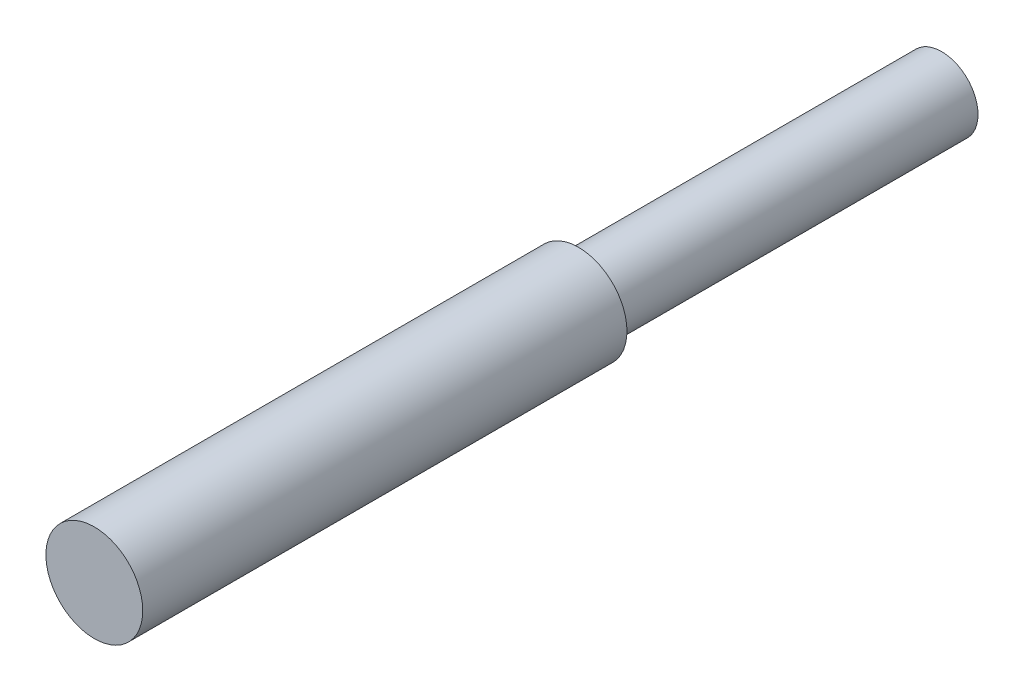
ISO-10303-21;
HEADER;
FILE_DESCRIPTION(('STEP AP214'),'2;1');
FILE_NAME('part.step','',(''),(''),'','','');
FILE_SCHEMA(('AUTOMOTIVE_DESIGN { 1 0 10303 214 1 1 1 1 }'));
ENDSEC;
DATA;
#1=APPLICATION_CONTEXT('core data for automotive mechanical design processes');
#2=APPLICATION_PROTOCOL_DEFINITION('international standard','automotive_design',2000,#1);
#3=PRODUCT_CONTEXT('',#1,'mechanical');
#4=PRODUCT('Part','Part','',(#3));
#5=PRODUCT_RELATED_PRODUCT_CATEGORY('part','',(#4));
#6=PRODUCT_DEFINITION_FORMATION('','',#4);
#7=PRODUCT_DEFINITION_CONTEXT('part definition',#1,'design');
#8=PRODUCT_DEFINITION('design','',#6,#7);
#9=PRODUCT_DEFINITION_SHAPE('','',#8);
#10=(LENGTH_UNIT() NAMED_UNIT(*) SI_UNIT(.MILLI.,.METRE.));
#11=(NAMED_UNIT(*) PLANE_ANGLE_UNIT() SI_UNIT($,.RADIAN.));
#12=(NAMED_UNIT(*) SI_UNIT($,.STERADIAN.) SOLID_ANGLE_UNIT());
#13=UNCERTAINTY_MEASURE_WITH_UNIT(LENGTH_MEASURE(1.E-05),#10,'distance_accuracy_value','');
#14=(GEOMETRIC_REPRESENTATION_CONTEXT(3) GLOBAL_UNCERTAINTY_ASSIGNED_CONTEXT((#13)) GLOBAL_UNIT_ASSIGNED_CONTEXT((#10,
#11,#12)) REPRESENTATION_CONTEXT('',''));
#15=CARTESIAN_POINT('',(0.,0.,0.));
#16=DIRECTION('',(0.,0.,1.));
#17=DIRECTION('',(1.,0.,0.));
#18=AXIS2_PLACEMENT_3D('',#15,#16,#17);
#19=CARTESIAN_POINT('',(0.,0.,150.));
#20=DIRECTION('',(0.,0.,-1.));
#21=DIRECTION('',(-1.,0.,0.));
#22=AXIS2_PLACEMENT_3D('',#19,#20,#21);
#23=CYLINDRICAL_SURFACE('',#22,15.);
#24=CARTESIAN_POINT('',(0.,0.,150.));
#25=DIRECTION('',(0.,0.,1.));
#26=DIRECTION('',(1.,0.,0.));
#27=AXIS2_PLACEMENT_3D('',#24,#25,#26);
#28=CIRCLE('',#27,15.);
#29=CARTESIAN_POINT('',(15.,0.,150.));
#30=VERTEX_POINT('',#29);
#31=EDGE_CURVE('E10',#30,#30,#28,.T.);
#32=ORIENTED_EDGE('',*,*,#31,.F.);
#33=EDGE_LOOP('',(#32));
#34=FACE_BOUND('',#33,.T.);
#35=CARTESIAN_POINT('',(0.,0.,0.));
#36=DIRECTION('',(0.,0.,1.));
#37=DIRECTION('',(1.,0.,0.));
#38=AXIS2_PLACEMENT_3D('',#35,#36,#37);
#39=CIRCLE('',#38,15.);
#40=CARTESIAN_POINT('',(15.,0.,0.));
#41=VERTEX_POINT('',#40);
#42=EDGE_CURVE('E40',#41,#41,#39,.T.);
#43=ORIENTED_EDGE('',*,*,#42,.T.);
#44=EDGE_LOOP('',(#43));
#45=FACE_BOUND('',#44,.T.);
#46=ADVANCED_FACE('F37',(#34,#45),#23,.T.);
#47=CARTESIAN_POINT('',(0.,0.,0.));
#48=DIRECTION('',(0.,0.,1.));
#49=DIRECTION('',(1.,0.,0.));
#50=AXIS2_PLACEMENT_3D('',#47,#48,#49);
#51=PLANE('',#50);
#52=ORIENTED_EDGE('',*,*,#42,.F.);
#53=EDGE_LOOP('',(#52));
#54=FACE_BOUND('',#53,.T.);
#55=ADVANCED_FACE('F64',(#54),#51,.F.);
#56=CARTESIAN_POINT('',(0.,0.,350.));
#57=DIRECTION('',(0.,0.,-1.));
#58=DIRECTION('',(-1.,0.,0.));
#59=AXIS2_PLACEMENT_3D('',#56,#57,#58);
#60=CYLINDRICAL_SURFACE('',#59,20.);
#61=CARTESIAN_POINT('',(0.,0.,350.));
#62=DIRECTION('',(0.,0.,1.));
#63=DIRECTION('',(1.,0.,0.));
#64=AXIS2_PLACEMENT_3D('',#61,#62,#63);
#65=CIRCLE('',#64,20.);
#66=CARTESIAN_POINT('',(20.,0.,350.));
#67=VERTEX_POINT('',#66);
#68=EDGE_CURVE('E49',#67,#67,#65,.T.);
#69=ORIENTED_EDGE('',*,*,#68,.F.);
#70=EDGE_LOOP('',(#69));
#71=FACE_BOUND('',#70,.T.);
#72=CARTESIAN_POINT('',(0.,0.,150.));
#73=DIRECTION('',(0.,0.,1.));
#74=DIRECTION('',(1.,0.,0.));
#75=AXIS2_PLACEMENT_3D('',#72,#73,#74);
#76=CIRCLE('',#75,20.);
#77=CARTESIAN_POINT('',(20.,0.,150.));
#78=VERTEX_POINT('',#77);
#79=EDGE_CURVE('E51',#78,#78,#76,.T.);
#80=ORIENTED_EDGE('',*,*,#79,.T.);
#81=EDGE_LOOP('',(#80));
#82=FACE_BOUND('',#81,.T.);
#83=ADVANCED_FACE('F61',(#71,#82),#60,.T.);
#84=CARTESIAN_POINT('',(0.,0.,350.));
#85=DIRECTION('',(0.,0.,1.));
#86=DIRECTION('',(1.,0.,0.));
#87=AXIS2_PLACEMENT_3D('',#84,#85,#86);
#88=PLANE('',#87);
#89=ORIENTED_EDGE('',*,*,#68,.T.);
#90=EDGE_LOOP('',(#89));
#91=FACE_BOUND('',#90,.T.);
#92=ADVANCED_FACE('F59',(#91),#88,.T.);
#93=CARTESIAN_POINT('',(0.,0.,150.));
#94=DIRECTION('',(0.,0.,1.));
#95=DIRECTION('',(1.,0.,0.));
#96=AXIS2_PLACEMENT_3D('',#93,#94,#95);
#97=PLANE('',#96);
#98=ORIENTED_EDGE('',*,*,#31,.T.);
#99=EDGE_LOOP('',(#98));
#100=FACE_BOUND('',#99,.T.);
#101=ORIENTED_EDGE('',*,*,#79,.F.);
#102=EDGE_LOOP('',(#101));
#103=FACE_BOUND('',#102,.T.);
#104=ADVANCED_FACE('F68',(#100,#103),#97,.F.);
#105=CLOSED_SHELL('',(#46,#55,#83,#92,#104));
#106=MANIFOLD_SOLID_BREP('B2',#105);
#107=ADVANCED_BREP_SHAPE_REPRESENTATION('',(#18,#106),#14);
#108=SHAPE_DEFINITION_REPRESENTATION(#9,#107);
ENDSEC;
END-ISO-10303-21;
